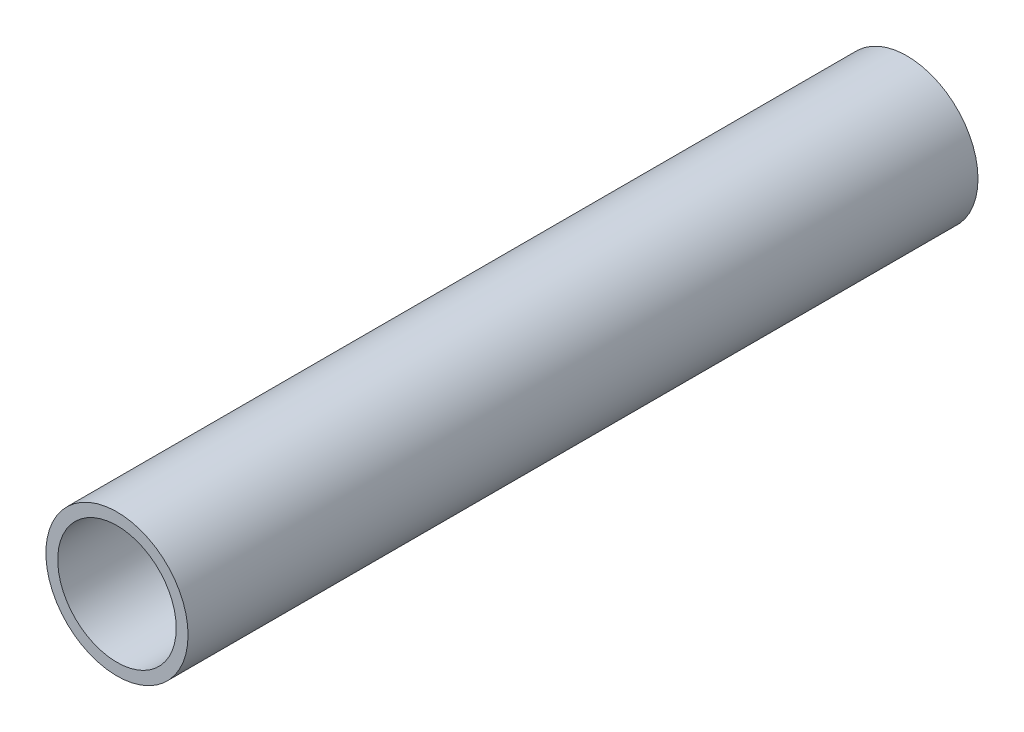
ISO-10303-21;
HEADER;
FILE_DESCRIPTION(('STEP AP214'),'2;1');
FILE_NAME('part.step','',(''),(''),'','','');
FILE_SCHEMA(('AUTOMOTIVE_DESIGN { 1 0 10303 214 1 1 1 1 }'));
ENDSEC;
DATA;
#1=APPLICATION_CONTEXT('core data for automotive mechanical design processes');
#2=APPLICATION_PROTOCOL_DEFINITION('international standard','automotive_design',2000,#1);
#3=PRODUCT_CONTEXT('',#1,'mechanical');
#4=PRODUCT('Part','Part','',(#3));
#5=PRODUCT_RELATED_PRODUCT_CATEGORY('part','',(#4));
#6=PRODUCT_DEFINITION_FORMATION('','',#4);
#7=PRODUCT_DEFINITION_CONTEXT('part definition',#1,'design');
#8=PRODUCT_DEFINITION('design','',#6,#7);
#9=PRODUCT_DEFINITION_SHAPE('','',#8);
#10=(LENGTH_UNIT() NAMED_UNIT(*) SI_UNIT(.MILLI.,.METRE.));
#11=(NAMED_UNIT(*) PLANE_ANGLE_UNIT() SI_UNIT($,.RADIAN.));
#12=(NAMED_UNIT(*) SI_UNIT($,.STERADIAN.) SOLID_ANGLE_UNIT());
#13=UNCERTAINTY_MEASURE_WITH_UNIT(LENGTH_MEASURE(1.E-05),#10,'distance_accuracy_value','');
#14=(GEOMETRIC_REPRESENTATION_CONTEXT(3) GLOBAL_UNCERTAINTY_ASSIGNED_CONTEXT((#13)) GLOBAL_UNIT_ASSIGNED_CONTEXT((#10,
#11,#12)) REPRESENTATION_CONTEXT('',''));
#15=CARTESIAN_POINT('',(0.,0.,0.));
#16=DIRECTION('',(0.,0.,1.));
#17=DIRECTION('',(1.,0.,0.));
#18=AXIS2_PLACEMENT_3D('',#15,#16,#17);
#19=CARTESIAN_POINT('',(0.,0.,100.));
#20=DIRECTION('',(0.,0.,1.));
#21=DIRECTION('',(1.,0.,0.));
#22=AXIS2_PLACEMENT_3D('',#19,#20,#21);
#23=PLANE('',#22);
#24=CARTESIAN_POINT('',(0.,0.,100.));
#25=DIRECTION('',(0.,0.,1.));
#26=DIRECTION('',(1.,0.,0.));
#27=AXIS2_PLACEMENT_3D('',#24,#25,#26);
#28=CIRCLE('',#27,9.);
#29=CARTESIAN_POINT('',(9.,0.,100.));
#30=VERTEX_POINT('',#29);
#31=EDGE_CURVE('E10',#30,#30,#28,.T.);
#32=ORIENTED_EDGE('',*,*,#31,.T.);
#33=EDGE_LOOP('',(#32));
#34=FACE_BOUND('',#33,.T.);
#35=CARTESIAN_POINT('',(0.,0.,100.));
#36=DIRECTION('',(0.,0.,1.));
#37=DIRECTION('',(1.,0.,0.));
#38=AXIS2_PLACEMENT_3D('',#35,#36,#37);
#39=CIRCLE('',#38,7.5);
#40=CARTESIAN_POINT('',(7.5,0.,100.));
#41=VERTEX_POINT('',#40);
#42=EDGE_CURVE('E50',#41,#41,#39,.T.);
#43=ORIENTED_EDGE('',*,*,#42,.F.);
#44=EDGE_LOOP('',(#43));
#45=FACE_BOUND('',#44,.T.);
#46=ADVANCED_FACE('F39',(#34,#45),#23,.T.);
#47=CARTESIAN_POINT('',(0.,0.,0.));
#48=DIRECTION('',(0.,0.,1.));
#49=DIRECTION('',(1.,0.,0.));
#50=AXIS2_PLACEMENT_3D('',#47,#48,#49);
#51=PLANE('',#50);
#52=CARTESIAN_POINT('',(0.,0.,0.));
#53=DIRECTION('',(0.,0.,1.));
#54=DIRECTION('',(1.,0.,0.));
#55=AXIS2_PLACEMENT_3D('',#52,#53,#54);
#56=CIRCLE('',#55,9.);
#57=CARTESIAN_POINT('',(9.,0.,0.));
#58=VERTEX_POINT('',#57);
#59=EDGE_CURVE('E43',#58,#58,#56,.T.);
#60=ORIENTED_EDGE('',*,*,#59,.F.);
#61=EDGE_LOOP('',(#60));
#62=FACE_BOUND('',#61,.T.);
#63=CARTESIAN_POINT('',(0.,0.,0.));
#64=DIRECTION('',(0.,0.,1.));
#65=DIRECTION('',(1.,0.,0.));
#66=AXIS2_PLACEMENT_3D('',#63,#64,#65);
#67=CIRCLE('',#66,7.5);
#68=CARTESIAN_POINT('',(7.5,0.,0.));
#69=VERTEX_POINT('',#68);
#70=EDGE_CURVE('E52',#69,#69,#67,.T.);
#71=ORIENTED_EDGE('',*,*,#70,.T.);
#72=EDGE_LOOP('',(#71));
#73=FACE_BOUND('',#72,.T.);
#74=ADVANCED_FACE('F62',(#62,#73),#51,.F.);
#75=CARTESIAN_POINT('',(0.,0.,100.));
#76=DIRECTION('',(0.,0.,-1.));
#77=DIRECTION('',(-1.,0.,0.));
#78=AXIS2_PLACEMENT_3D('',#75,#76,#77);
#79=CYLINDRICAL_SURFACE('',#78,9.);
#80=ORIENTED_EDGE('',*,*,#31,.F.);
#81=EDGE_LOOP('',(#80));
#82=FACE_BOUND('',#81,.T.);
#83=ORIENTED_EDGE('',*,*,#59,.T.);
#84=EDGE_LOOP('',(#83));
#85=FACE_BOUND('',#84,.T.);
#86=ADVANCED_FACE('F41',(#82,#85),#79,.T.);
#87=CARTESIAN_POINT('',(0.,0.,100.));
#88=DIRECTION('',(0.,0.,-1.));
#89=DIRECTION('',(-1.,0.,0.));
#90=AXIS2_PLACEMENT_3D('',#87,#88,#89);
#91=CYLINDRICAL_SURFACE('',#90,7.5);
#92=ORIENTED_EDGE('',*,*,#42,.T.);
#93=EDGE_LOOP('',(#92));
#94=FACE_BOUND('',#93,.T.);
#95=ORIENTED_EDGE('',*,*,#70,.F.);
#96=EDGE_LOOP('',(#95));
#97=FACE_BOUND('',#96,.T.);
#98=ADVANCED_FACE('F58',(#94,#97),#91,.F.);
#99=CLOSED_SHELL('',(#46,#74,#86,#98));
#100=MANIFOLD_SOLID_BREP('B2',#99);
#101=ADVANCED_BREP_SHAPE_REPRESENTATION('',(#18,#100),#14);
#102=SHAPE_DEFINITION_REPRESENTATION(#9,#101);
ENDSEC;
END-ISO-10303-21;
